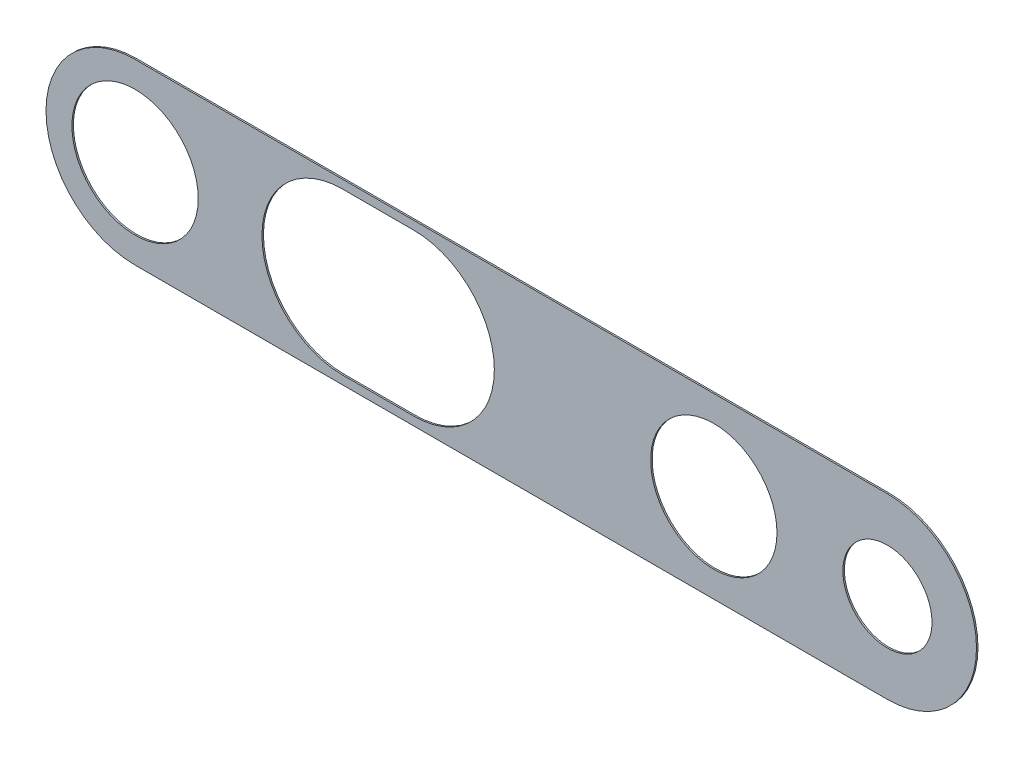
ISO-10303-21;
HEADER;
FILE_DESCRIPTION(('STEP AP214'),'2;1');
FILE_NAME('part.step','',(''),(''),'','','');
FILE_SCHEMA(('AUTOMOTIVE_DESIGN { 1 0 10303 214 1 1 1 1 }'));
ENDSEC;
DATA;
#1=APPLICATION_CONTEXT('core data for automotive mechanical design processes');
#2=APPLICATION_PROTOCOL_DEFINITION('international standard','automotive_design',2000,#1);
#3=PRODUCT_CONTEXT('',#1,'mechanical');
#4=PRODUCT('Part','Part','',(#3));
#5=PRODUCT_RELATED_PRODUCT_CATEGORY('part','',(#4));
#6=PRODUCT_DEFINITION_FORMATION('','',#4);
#7=PRODUCT_DEFINITION_CONTEXT('part definition',#1,'design');
#8=PRODUCT_DEFINITION('design','',#6,#7);
#9=PRODUCT_DEFINITION_SHAPE('','',#8);
#10=(LENGTH_UNIT() NAMED_UNIT(*) SI_UNIT(.MILLI.,.METRE.));
#11=(NAMED_UNIT(*) PLANE_ANGLE_UNIT() SI_UNIT($,.RADIAN.));
#12=(NAMED_UNIT(*) SI_UNIT($,.STERADIAN.) SOLID_ANGLE_UNIT());
#13=UNCERTAINTY_MEASURE_WITH_UNIT(LENGTH_MEASURE(1.E-05),#10,'distance_accuracy_value','');
#14=(GEOMETRIC_REPRESENTATION_CONTEXT(3) GLOBAL_UNCERTAINTY_ASSIGNED_CONTEXT((#13)) GLOBAL_UNIT_ASSIGNED_CONTEXT((#10,
#11,#12)) REPRESENTATION_CONTEXT('',''));
#15=CARTESIAN_POINT('',(0.,0.,0.));
#16=DIRECTION('',(0.,0.,1.));
#17=DIRECTION('',(1.,0.,0.));
#18=AXIS2_PLACEMENT_3D('',#15,#16,#17);
#19=CARTESIAN_POINT('',(0.,0.,-0.675));
#20=DIRECTION('',(0.,0.,1.));
#21=DIRECTION('',(1.,0.,0.));
#22=AXIS2_PLACEMENT_3D('',#19,#20,#21);
#23=PLANE('',#22);
#24=DIRECTION('',(1.,0.,0.));
#25=VECTOR('',#24,1.);
#26=CARTESIAN_POINT('',(-14.58342148133,-6.955,-0.675));
#27=LINE('',#26,#25);
#28=CARTESIAN_POINT('',(-8.416578518674,-6.955,-0.675));
#29=VERTEX_POINT('',#28);
#30=CARTESIAN_POINT('',(-14.58342148133,-6.955,-0.675));
#31=VERTEX_POINT('',#30);
#32=EDGE_CURVE('E149',#29,#31,#27,.F.);
#33=ORIENTED_EDGE('',*,*,#32,.T.);
#34=CARTESIAN_POINT('',(-14.58342148133,0.,-0.675));
#35=DIRECTION('',(0.,0.,1.));
#36=DIRECTION('',(1.,0.,0.));
#37=AXIS2_PLACEMENT_3D('',#34,#35,#36);
#38=CIRCLE('',#37,6.955);
#39=CARTESIAN_POINT('',(-14.58342148133,6.955,-0.675));
#40=VERTEX_POINT('',#39);
#41=EDGE_CURVE('E136',#31,#40,#38,.F.);
#42=ORIENTED_EDGE('',*,*,#41,.T.);
#43=DIRECTION('',(1.,0.,0.));
#44=VECTOR('',#43,1.);
#45=CARTESIAN_POINT('',(-8.416578518674,6.955,-0.675));
#46=LINE('',#45,#44);
#47=CARTESIAN_POINT('',(-8.416578518674,6.955,-0.675));
#48=VERTEX_POINT('',#47);
#49=EDGE_CURVE('E107',#40,#48,#46,.T.);
#50=ORIENTED_EDGE('',*,*,#49,.T.);
#51=CARTESIAN_POINT('',(-8.416578518674,0.,-0.675));
#52=DIRECTION('',(0.,0.,1.));
#53=DIRECTION('',(1.,0.,0.));
#54=AXIS2_PLACEMENT_3D('',#51,#52,#53);
#55=CIRCLE('',#54,6.955);
#56=EDGE_CURVE('E131',#48,#29,#55,.F.);
#57=ORIENTED_EDGE('',*,*,#56,.T.);
#58=EDGE_LOOP('',(#33,#42,#50,#57));
#59=FACE_BOUND('',#58,.T.);
#60=CARTESIAN_POINT('',(32.5,0.,-0.675));
#61=DIRECTION('',(0.,0.,1.));
#62=DIRECTION('',(1.,0.,0.));
#63=AXIS2_PLACEMENT_3D('',#60,#61,#62);
#64=CIRCLE('',#63,3.850253178006);
#65=CARTESIAN_POINT('',(36.350253178006,0.,-0.675));
#66=VERTEX_POINT('',#65);
#67=EDGE_CURVE('E139',#66,#66,#64,.F.);
#68=ORIENTED_EDGE('',*,*,#67,.T.);
#69=EDGE_LOOP('',(#68));
#70=FACE_BOUND('',#69,.T.);
#71=CARTESIAN_POINT('',(17.5,0.,-0.675));
#72=DIRECTION('',(0.,0.,1.));
#73=DIRECTION('',(1.,0.,0.));
#74=AXIS2_PLACEMENT_3D('',#71,#72,#73);
#75=CIRCLE('',#74,5.456671541071);
#76=CARTESIAN_POINT('',(22.956671541071,0.,-0.675));
#77=VERTEX_POINT('',#76);
#78=EDGE_CURVE('E103',#77,#77,#75,.F.);
#79=ORIENTED_EDGE('',*,*,#78,.T.);
#80=EDGE_LOOP('',(#79));
#81=FACE_BOUND('',#80,.T.);
#82=CARTESIAN_POINT('',(-32.5,0.,-0.675));
#83=DIRECTION('',(0.,0.,1.));
#84=DIRECTION('',(1.,0.,0.));
#85=AXIS2_PLACEMENT_3D('',#82,#83,#84);
#86=CIRCLE('',#85,5.456671541071);
#87=CARTESIAN_POINT('',(-27.043328458929,0.,-0.675));
#88=VERTEX_POINT('',#87);
#89=EDGE_CURVE('E100',#88,#88,#86,.F.);
#90=ORIENTED_EDGE('',*,*,#89,.T.);
#91=EDGE_LOOP('',(#90));
#92=FACE_BOUND('',#91,.T.);
#93=CARTESIAN_POINT('',(32.5,0.,-0.675));
#94=DIRECTION('',(0.,0.,1.));
#95=DIRECTION('',(1.,0.,0.));
#96=AXIS2_PLACEMENT_3D('',#93,#94,#95);
#97=CIRCLE('',#96,7.695);
#98=CARTESIAN_POINT('',(32.5,7.695,-0.675));
#99=VERTEX_POINT('',#98);
#100=CARTESIAN_POINT('',(32.5,-7.695,-0.675));
#101=VERTEX_POINT('',#100);
#102=EDGE_CURVE('E20',#99,#101,#97,.F.);
#103=ORIENTED_EDGE('',*,*,#102,.F.);
#104=DIRECTION('',(1.,0.,0.));
#105=VECTOR('',#104,1.);
#106=CARTESIAN_POINT('',(32.5,7.695,-0.675));
#107=LINE('',#106,#105);
#108=CARTESIAN_POINT('',(-32.5,7.695,-0.675));
#109=VERTEX_POINT('',#108);
#110=EDGE_CURVE('E109',#109,#99,#107,.T.);
#111=ORIENTED_EDGE('',*,*,#110,.F.);
#112=CARTESIAN_POINT('',(-32.5,0.,-0.675));
#113=DIRECTION('',(0.,0.,1.));
#114=DIRECTION('',(1.,0.,0.));
#115=AXIS2_PLACEMENT_3D('',#112,#113,#114);
#116=CIRCLE('',#115,7.695);
#117=CARTESIAN_POINT('',(-32.5,-7.695,-0.675));
#118=VERTEX_POINT('',#117);
#119=EDGE_CURVE('E99',#118,#109,#116,.F.);
#120=ORIENTED_EDGE('',*,*,#119,.F.);
#121=DIRECTION('',(1.,0.,0.));
#122=VECTOR('',#121,1.);
#123=CARTESIAN_POINT('',(-32.5,-7.695,-0.675));
#124=LINE('',#123,#122);
#125=EDGE_CURVE('E92',#101,#118,#124,.F.);
#126=ORIENTED_EDGE('',*,*,#125,.F.);
#127=EDGE_LOOP('',(#103,#111,#120,#126));
#128=FACE_BOUND('',#127,.T.);
#129=ADVANCED_FACE('F17',(#59,#70,#81,#92,#128),#23,.T.);
#130=CARTESIAN_POINT('',(32.5,0.,-0.675));
#131=DIRECTION('',(0.,0.,1.));
#132=DIRECTION('',(1.,0.,0.));
#133=AXIS2_PLACEMENT_3D('',#130,#131,#132);
#134=CYLINDRICAL_SURFACE('',#133,7.695);
#135=DIRECTION('',(0.,0.,1.));
#136=VECTOR('',#135,1.);
#137=CARTESIAN_POINT('',(32.5,7.695,-0.675));
#138=LINE('',#137,#136);
#139=CARTESIAN_POINT('',(32.5,7.695,-0.805));
#140=VERTEX_POINT('',#139);
#141=EDGE_CURVE('E84',#99,#140,#138,.F.);
#142=ORIENTED_EDGE('',*,*,#141,.F.);
#143=ORIENTED_EDGE('',*,*,#102,.T.);
#144=DIRECTION('',(0.,0.,-1.));
#145=VECTOR('',#144,1.);
#146=CARTESIAN_POINT('',(32.5,-7.695,-0.675));
#147=LINE('',#146,#145);
#148=CARTESIAN_POINT('',(32.5,-7.695,-0.805));
#149=VERTEX_POINT('',#148);
#150=EDGE_CURVE('E81',#149,#101,#147,.F.);
#151=ORIENTED_EDGE('',*,*,#150,.F.);
#152=CARTESIAN_POINT('',(32.5,0.,-0.805));
#153=DIRECTION('',(0.,0.,1.));
#154=DIRECTION('',(1.,0.,0.));
#155=AXIS2_PLACEMENT_3D('',#152,#153,#154);
#156=CIRCLE('',#155,7.695);
#157=EDGE_CURVE('E128',#149,#140,#156,.T.);
#158=ORIENTED_EDGE('',*,*,#157,.T.);
#159=EDGE_LOOP('',(#142,#143,#151,#158));
#160=FACE_BOUND('',#159,.T.);
#161=ADVANCED_FACE('F80',(#160),#134,.T.);
#162=CARTESIAN_POINT('',(32.5,7.695,-0.675));
#163=DIRECTION('',(0.,1.,0.));
#164=DIRECTION('',(0.,0.,1.));
#165=AXIS2_PLACEMENT_3D('',#162,#163,#164);
#166=PLANE('',#165);
#167=DIRECTION('',(0.,0.,1.));
#168=VECTOR('',#167,1.);
#169=CARTESIAN_POINT('',(-32.5,7.695,-0.675));
#170=LINE('',#169,#168);
#171=CARTESIAN_POINT('',(-32.5,7.695,-0.805));
#172=VERTEX_POINT('',#171);
#173=EDGE_CURVE('E111',#109,#172,#170,.F.);
#174=ORIENTED_EDGE('',*,*,#173,.F.);
#175=ORIENTED_EDGE('',*,*,#110,.T.);
#176=ORIENTED_EDGE('',*,*,#141,.T.);
#177=DIRECTION('',(1.,0.,0.));
#178=VECTOR('',#177,1.);
#179=CARTESIAN_POINT('',(0.,7.695,-0.805));
#180=LINE('',#179,#178);
#181=EDGE_CURVE('E127',#140,#172,#180,.F.);
#182=ORIENTED_EDGE('',*,*,#181,.T.);
#183=EDGE_LOOP('',(#174,#175,#176,#182));
#184=FACE_BOUND('',#183,.T.);
#185=ADVANCED_FACE('F270',(#184),#166,.T.);
#186=CARTESIAN_POINT('',(-32.5,0.,-0.675));
#187=DIRECTION('',(0.,0.,1.));
#188=DIRECTION('',(1.,0.,0.));
#189=AXIS2_PLACEMENT_3D('',#186,#187,#188);
#190=CYLINDRICAL_SURFACE('',#189,7.695);
#191=DIRECTION('',(0.,0.,-1.));
#192=VECTOR('',#191,1.);
#193=CARTESIAN_POINT('',(-32.5,-7.695,-0.675));
#194=LINE('',#193,#192);
#195=CARTESIAN_POINT('',(-32.5,-7.695,-0.805));
#196=VERTEX_POINT('',#195);
#197=EDGE_CURVE('E96',#118,#196,#194,.T.);
#198=ORIENTED_EDGE('',*,*,#197,.F.);
#199=ORIENTED_EDGE('',*,*,#119,.T.);
#200=ORIENTED_EDGE('',*,*,#173,.T.);
#201=CARTESIAN_POINT('',(-32.5,0.,-0.805));
#202=DIRECTION('',(0.,0.,1.));
#203=DIRECTION('',(1.,0.,0.));
#204=AXIS2_PLACEMENT_3D('',#201,#202,#203);
#205=CIRCLE('',#204,7.695);
#206=EDGE_CURVE('E125',#172,#196,#205,.T.);
#207=ORIENTED_EDGE('',*,*,#206,.T.);
#208=EDGE_LOOP('',(#198,#199,#200,#207));
#209=FACE_BOUND('',#208,.T.);
#210=ADVANCED_FACE('F262',(#209),#190,.T.);
#211=CARTESIAN_POINT('',(-32.5,-7.695,-0.675));
#212=DIRECTION('',(0.,-1.,0.));
#213=DIRECTION('',(0.,0.,-1.));
#214=AXIS2_PLACEMENT_3D('',#211,#212,#213);
#215=PLANE('',#214);
#216=ORIENTED_EDGE('',*,*,#150,.T.);
#217=ORIENTED_EDGE('',*,*,#125,.T.);
#218=ORIENTED_EDGE('',*,*,#197,.T.);
#219=DIRECTION('',(1.,0.,0.));
#220=VECTOR('',#219,1.);
#221=CARTESIAN_POINT('',(0.,-7.695,-0.805));
#222=LINE('',#221,#220);
#223=EDGE_CURVE('E95',#196,#149,#222,.T.);
#224=ORIENTED_EDGE('',*,*,#223,.T.);
#225=EDGE_LOOP('',(#216,#217,#218,#224));
#226=FACE_BOUND('',#225,.T.);
#227=ADVANCED_FACE('F90',(#226),#215,.T.);
#228=CARTESIAN_POINT('',(-32.5,0.,0.));
#229=DIRECTION('',(0.,0.,1.));
#230=DIRECTION('',(1.,0.,0.));
#231=AXIS2_PLACEMENT_3D('',#228,#229,#230);
#232=CYLINDRICAL_SURFACE('',#231,5.456671541071);
#233=CARTESIAN_POINT('',(-32.5,0.,-0.805));
#234=DIRECTION('',(0.,0.,1.));
#235=DIRECTION('',(1.,0.,0.));
#236=AXIS2_PLACEMENT_3D('',#233,#234,#235);
#237=CIRCLE('',#236,5.456671541071);
#238=CARTESIAN_POINT('',(-27.043328458929,0.,-0.805));
#239=VERTEX_POINT('',#238);
#240=EDGE_CURVE('E122',#239,#239,#237,.F.);
#241=ORIENTED_EDGE('',*,*,#240,.T.);
#242=EDGE_LOOP('',(#241));
#243=FACE_BOUND('',#242,.T.);
#244=ORIENTED_EDGE('',*,*,#89,.F.);
#245=EDGE_LOOP('',(#244));
#246=FACE_BOUND('',#245,.T.);
#247=ADVANCED_FACE('F245',(#243,#246),#232,.F.);
#248=CARTESIAN_POINT('',(17.5,0.,0.));
#249=DIRECTION('',(0.,0.,1.));
#250=DIRECTION('',(1.,0.,0.));
#251=AXIS2_PLACEMENT_3D('',#248,#249,#250);
#252=CYLINDRICAL_SURFACE('',#251,5.456671541071);
#253=CARTESIAN_POINT('',(17.5,0.,-0.805));
#254=DIRECTION('',(0.,0.,1.));
#255=DIRECTION('',(1.,0.,0.));
#256=AXIS2_PLACEMENT_3D('',#253,#254,#255);
#257=CIRCLE('',#256,5.456671541071);
#258=CARTESIAN_POINT('',(22.956671541071,0.,-0.805));
#259=VERTEX_POINT('',#258);
#260=EDGE_CURVE('E119',#259,#259,#257,.F.);
#261=ORIENTED_EDGE('',*,*,#260,.T.);
#262=EDGE_LOOP('',(#261));
#263=FACE_BOUND('',#262,.T.);
#264=ORIENTED_EDGE('',*,*,#78,.F.);
#265=EDGE_LOOP('',(#264));
#266=FACE_BOUND('',#265,.T.);
#267=ADVANCED_FACE('F190',(#263,#266),#252,.F.);
#268=CARTESIAN_POINT('',(32.5,0.,0.));
#269=DIRECTION('',(0.,0.,1.));
#270=DIRECTION('',(1.,0.,0.));
#271=AXIS2_PLACEMENT_3D('',#268,#269,#270);
#272=CYLINDRICAL_SURFACE('',#271,3.850253178006);
#273=CARTESIAN_POINT('',(32.5,0.,-0.805));
#274=DIRECTION('',(0.,0.,1.));
#275=DIRECTION('',(1.,0.,0.));
#276=AXIS2_PLACEMENT_3D('',#273,#274,#275);
#277=CIRCLE('',#276,3.850253178006);
#278=CARTESIAN_POINT('',(36.350253178006,0.,-0.805));
#279=VERTEX_POINT('',#278);
#280=EDGE_CURVE('E116',#279,#279,#277,.F.);
#281=ORIENTED_EDGE('',*,*,#280,.T.);
#282=EDGE_LOOP('',(#281));
#283=FACE_BOUND('',#282,.T.);
#284=ORIENTED_EDGE('',*,*,#67,.F.);
#285=EDGE_LOOP('',(#284));
#286=FACE_BOUND('',#285,.T.);
#287=ADVANCED_FACE('F182',(#283,#286),#272,.F.);
#288=CARTESIAN_POINT('',(-14.58342148133,0.,0.));
#289=DIRECTION('',(0.,0.,1.));
#290=DIRECTION('',(1.,0.,0.));
#291=AXIS2_PLACEMENT_3D('',#288,#289,#290);
#292=CYLINDRICAL_SURFACE('',#291,6.955);
#293=CARTESIAN_POINT('',(-14.58342148133,0.,-0.805));
#294=DIRECTION('',(0.,0.,1.));
#295=DIRECTION('',(1.,0.,0.));
#296=AXIS2_PLACEMENT_3D('',#293,#294,#295);
#297=CIRCLE('',#296,6.955);
#298=CARTESIAN_POINT('',(-14.58342148133,-6.955,-0.805));
#299=VERTEX_POINT('',#298);
#300=CARTESIAN_POINT('',(-14.58342148133,6.955,-0.805));
#301=VERTEX_POINT('',#300);
#302=EDGE_CURVE('E114',#299,#301,#297,.F.);
#303=ORIENTED_EDGE('',*,*,#302,.T.);
#304=DIRECTION('',(0.,0.,1.));
#305=VECTOR('',#304,1.);
#306=CARTESIAN_POINT('',(-14.58342148133,6.955,0.));
#307=LINE('',#306,#305);
#308=EDGE_CURVE('E135',#301,#40,#307,.T.);
#309=ORIENTED_EDGE('',*,*,#308,.T.);
#310=ORIENTED_EDGE('',*,*,#41,.F.);
#311=DIRECTION('',(0.,0.,-1.));
#312=VECTOR('',#311,1.);
#313=CARTESIAN_POINT('',(-14.58342148133,-6.955,0.));
#314=LINE('',#313,#312);
#315=EDGE_CURVE('E151',#31,#299,#314,.T.);
#316=ORIENTED_EDGE('',*,*,#315,.T.);
#317=EDGE_LOOP('',(#303,#309,#310,#316));
#318=FACE_BOUND('',#317,.T.);
#319=ADVANCED_FACE('F180',(#318),#292,.F.);
#320=CARTESIAN_POINT('',(-8.416578518674,6.955,0.));
#321=DIRECTION('',(0.,1.,0.));
#322=DIRECTION('',(0.,0.,1.));
#323=AXIS2_PLACEMENT_3D('',#320,#321,#322);
#324=PLANE('',#323);
#325=DIRECTION('',(1.,0.,0.));
#326=VECTOR('',#325,1.);
#327=CARTESIAN_POINT('',(0.,6.955,-0.805));
#328=LINE('',#327,#326);
#329=CARTESIAN_POINT('',(-8.416578518674,6.955,-0.805));
#330=VERTEX_POINT('',#329);
#331=EDGE_CURVE('E113',#301,#330,#328,.T.);
#332=ORIENTED_EDGE('',*,*,#331,.T.);
#333=DIRECTION('',(0.,0.,1.));
#334=VECTOR('',#333,1.);
#335=CARTESIAN_POINT('',(-8.416578518674,6.955,0.));
#336=LINE('',#335,#334);
#337=EDGE_CURVE('E134',#330,#48,#336,.T.);
#338=ORIENTED_EDGE('',*,*,#337,.T.);
#339=ORIENTED_EDGE('',*,*,#49,.F.);
#340=ORIENTED_EDGE('',*,*,#308,.F.);
#341=EDGE_LOOP('',(#332,#338,#339,#340));
#342=FACE_BOUND('',#341,.T.);
#343=ADVANCED_FACE('F166',(#342),#324,.F.);
#344=CARTESIAN_POINT('',(-8.416578518674,0.,0.));
#345=DIRECTION('',(0.,0.,1.));
#346=DIRECTION('',(1.,0.,0.));
#347=AXIS2_PLACEMENT_3D('',#344,#345,#346);
#348=CYLINDRICAL_SURFACE('',#347,6.955);
#349=CARTESIAN_POINT('',(-8.416578518674,0.,-0.805));
#350=DIRECTION('',(0.,0.,1.));
#351=DIRECTION('',(1.,0.,0.));
#352=AXIS2_PLACEMENT_3D('',#349,#350,#351);
#353=CIRCLE('',#352,6.955);
#354=CARTESIAN_POINT('',(-8.416578518674,-6.955,-0.805));
#355=VERTEX_POINT('',#354);
#356=EDGE_CURVE('E26',#330,#355,#353,.F.);
#357=ORIENTED_EDGE('',*,*,#356,.T.);
#358=DIRECTION('',(0.,0.,-1.));
#359=VECTOR('',#358,1.);
#360=CARTESIAN_POINT('',(-8.416578518674,-6.955,0.));
#361=LINE('',#360,#359);
#362=EDGE_CURVE('E130',#355,#29,#361,.F.);
#363=ORIENTED_EDGE('',*,*,#362,.T.);
#364=ORIENTED_EDGE('',*,*,#56,.F.);
#365=ORIENTED_EDGE('',*,*,#337,.F.);
#366=EDGE_LOOP('',(#357,#363,#364,#365));
#367=FACE_BOUND('',#366,.T.);
#368=ADVANCED_FACE('F176',(#367),#348,.F.);
#369=CARTESIAN_POINT('',(-14.58342148133,-6.955,0.));
#370=DIRECTION('',(0.,-1.,0.));
#371=DIRECTION('',(0.,0.,-1.));
#372=AXIS2_PLACEMENT_3D('',#369,#370,#371);
#373=PLANE('',#372);
#374=DIRECTION('',(1.,0.,0.));
#375=VECTOR('',#374,1.);
#376=CARTESIAN_POINT('',(0.,-6.955,-0.805));
#377=LINE('',#376,#375);
#378=EDGE_CURVE('E11',#355,#299,#377,.F.);
#379=ORIENTED_EDGE('',*,*,#378,.T.);
#380=ORIENTED_EDGE('',*,*,#315,.F.);
#381=ORIENTED_EDGE('',*,*,#32,.F.);
#382=ORIENTED_EDGE('',*,*,#362,.F.);
#383=EDGE_LOOP('',(#379,#380,#381,#382));
#384=FACE_BOUND('',#383,.T.);
#385=ADVANCED_FACE('F178',(#384),#373,.F.);
#386=CARTESIAN_POINT('',(0.,0.,-0.805));
#387=DIRECTION('',(0.,0.,1.));
#388=DIRECTION('',(1.,0.,0.));
#389=AXIS2_PLACEMENT_3D('',#386,#387,#388);
#390=PLANE('',#389);
#391=ORIENTED_EDGE('',*,*,#378,.F.);
#392=ORIENTED_EDGE('',*,*,#356,.F.);
#393=ORIENTED_EDGE('',*,*,#331,.F.);
#394=ORIENTED_EDGE('',*,*,#302,.F.);
#395=EDGE_LOOP('',(#391,#392,#393,#394));
#396=FACE_BOUND('',#395,.T.);
#397=ORIENTED_EDGE('',*,*,#280,.F.);
#398=EDGE_LOOP('',(#397));
#399=FACE_BOUND('',#398,.T.);
#400=ORIENTED_EDGE('',*,*,#260,.F.);
#401=EDGE_LOOP('',(#400));
#402=FACE_BOUND('',#401,.T.);
#403=ORIENTED_EDGE('',*,*,#240,.F.);
#404=EDGE_LOOP('',(#403));
#405=FACE_BOUND('',#404,.T.);
#406=ORIENTED_EDGE('',*,*,#223,.F.);
#407=ORIENTED_EDGE('',*,*,#206,.F.);
#408=ORIENTED_EDGE('',*,*,#181,.F.);
#409=ORIENTED_EDGE('',*,*,#157,.F.);
#410=EDGE_LOOP('',(#406,#407,#408,#409));
#411=FACE_BOUND('',#410,.T.);
#412=ADVANCED_FACE('F170',(#396,#399,#402,#405,#411),#390,.F.);
#413=CLOSED_SHELL('',(#129,#161,#185,#210,#227,#247,#267,#287,#319,#343,#368,#385,#412));
#414=MANIFOLD_SOLID_BREP('B1',#413);
#415=ADVANCED_BREP_SHAPE_REPRESENTATION('',(#18,#414),#14);
#416=SHAPE_DEFINITION_REPRESENTATION(#9,#415);
ENDSEC;
END-ISO-10303-21;
